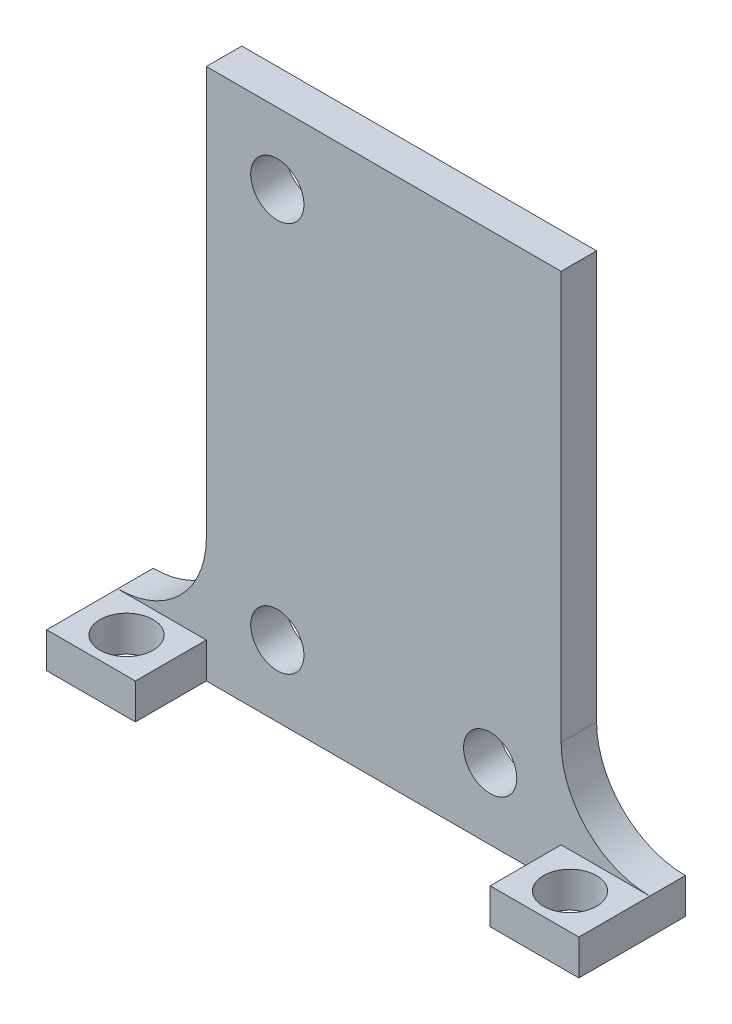
ISO-10303-21;
HEADER;
FILE_DESCRIPTION(('STEP AP214'),'2;1');
FILE_NAME('part.step','',(''),(''),'','','');
FILE_SCHEMA(('AUTOMOTIVE_DESIGN { 1 0 10303 214 1 1 1 1 }'));
ENDSEC;
DATA;
#1=APPLICATION_CONTEXT('core data for automotive mechanical design processes');
#2=APPLICATION_PROTOCOL_DEFINITION('international standard','automotive_design',2000,#1);
#3=PRODUCT_CONTEXT('',#1,'mechanical');
#4=PRODUCT('Part','Part','',(#3));
#5=PRODUCT_RELATED_PRODUCT_CATEGORY('part','',(#4));
#6=PRODUCT_DEFINITION_FORMATION('','',#4);
#7=PRODUCT_DEFINITION_CONTEXT('part definition',#1,'design');
#8=PRODUCT_DEFINITION('design','',#6,#7);
#9=PRODUCT_DEFINITION_SHAPE('','',#8);
#10=(LENGTH_UNIT() NAMED_UNIT(*) SI_UNIT(.MILLI.,.METRE.));
#11=(NAMED_UNIT(*) PLANE_ANGLE_UNIT() SI_UNIT($,.RADIAN.));
#12=(NAMED_UNIT(*) SI_UNIT($,.STERADIAN.) SOLID_ANGLE_UNIT());
#13=UNCERTAINTY_MEASURE_WITH_UNIT(LENGTH_MEASURE(1.E-05),#10,'distance_accuracy_value','');
#14=(GEOMETRIC_REPRESENTATION_CONTEXT(3) GLOBAL_UNCERTAINTY_ASSIGNED_CONTEXT((#13)) GLOBAL_UNIT_ASSIGNED_CONTEXT((#10,
#11,#12)) REPRESENTATION_CONTEXT('',''));
#15=CARTESIAN_POINT('',(0.,0.,0.));
#16=DIRECTION('',(0.,0.,1.));
#17=DIRECTION('',(1.,0.,0.));
#18=AXIS2_PLACEMENT_3D('',#15,#16,#17);
#19=CARTESIAN_POINT('',(12.7,-19.05,1.27));
#20=DIRECTION('',(-1.,0.,0.));
#21=DIRECTION('',(0.,0.,1.));
#22=AXIS2_PLACEMENT_3D('',#19,#20,#21);
#23=PLANE('',#22);
#24=DIRECTION('',(0.,1.,0.));
#25=VECTOR('',#24,1.);
#26=CARTESIAN_POINT('',(12.7,-19.05,1.27));
#27=LINE('',#26,#25);
#28=CARTESIAN_POINT('',(12.7,-10.16,1.27));
#29=VERTEX_POINT('',#28);
#30=CARTESIAN_POINT('',(12.7,19.05,1.27));
#31=VERTEX_POINT('',#30);
#32=EDGE_CURVE('E265',#29,#31,#27,.T.);
#33=ORIENTED_EDGE('',*,*,#32,.F.);
#34=DIRECTION('',(0.,0.,1.));
#35=VECTOR('',#34,1.);
#36=CARTESIAN_POINT('',(12.7,-10.16,1.27));
#37=LINE('',#36,#35);
#38=CARTESIAN_POINT('',(12.7,-10.16,-1.27));
#39=VERTEX_POINT('',#38);
#40=EDGE_CURVE('E298',#29,#39,#37,.F.);
#41=ORIENTED_EDGE('',*,*,#40,.T.);
#42=DIRECTION('',(0.,1.,0.));
#43=VECTOR('',#42,1.);
#44=CARTESIAN_POINT('',(12.7,-19.05,-1.27));
#45=LINE('',#44,#43);
#46=CARTESIAN_POINT('',(12.7,19.05,-1.27));
#47=VERTEX_POINT('',#46);
#48=EDGE_CURVE('E145',#39,#47,#45,.T.);
#49=ORIENTED_EDGE('',*,*,#48,.T.);
#50=DIRECTION('',(0.,0.,-1.));
#51=VECTOR('',#50,1.);
#52=CARTESIAN_POINT('',(12.7,19.05,1.27));
#53=LINE('',#52,#51);
#54=EDGE_CURVE('E291',#31,#47,#53,.T.);
#55=ORIENTED_EDGE('',*,*,#54,.F.);
#56=EDGE_LOOP('',(#33,#41,#49,#55));
#57=FACE_BOUND('',#56,.T.);
#58=ADVANCED_FACE('F45',(#57),#23,.F.);
#59=CARTESIAN_POINT('',(0.,0.,1.27));
#60=DIRECTION('',(0.,0.,-1.));
#61=DIRECTION('',(-1.,0.,0.));
#62=AXIS2_PLACEMENT_3D('',#59,#60,#61);
#63=PLANE('',#62);
#64=CARTESIAN_POINT('',(12.7,-19.05,1.27));
#65=VERTEX_POINT('',#64);
#66=CARTESIAN_POINT('',(12.7,-16.51,1.27));
#67=VERTEX_POINT('',#66);
#68=EDGE_CURVE('E260',#65,#67,#27,.T.);
#69=ORIENTED_EDGE('',*,*,#68,.T.);
#70=DIRECTION('',(-1.,0.,0.));
#71=VECTOR('',#70,1.);
#72=CARTESIAN_POINT('',(0.,-16.51,1.27));
#73=LINE('',#72,#71);
#74=CARTESIAN_POINT('',(19.05,-16.51,1.27));
#75=VERTEX_POINT('',#74);
#76=EDGE_CURVE('E295',#75,#67,#73,.T.);
#77=ORIENTED_EDGE('',*,*,#76,.F.);
#78=CARTESIAN_POINT('',(19.05,-10.16,1.27));
#79=DIRECTION('',(0.,0.,-1.));
#80=DIRECTION('',(-1.,0.,0.));
#81=AXIS2_PLACEMENT_3D('',#78,#79,#80);
#82=CIRCLE('',#81,6.35);
#83=EDGE_CURVE('E150',#75,#29,#82,.T.);
#84=ORIENTED_EDGE('',*,*,#83,.T.);
#85=ORIENTED_EDGE('',*,*,#32,.T.);
#86=DIRECTION('',(-1.,0.,0.));
#87=VECTOR('',#86,1.);
#88=CARTESIAN_POINT('',(-12.7,19.05,1.27));
#89=LINE('',#88,#87);
#90=CARTESIAN_POINT('',(-12.7,19.05,1.27));
#91=VERTEX_POINT('',#90);
#92=EDGE_CURVE('E264',#31,#91,#89,.T.);
#93=ORIENTED_EDGE('',*,*,#92,.T.);
#94=DIRECTION('',(0.,-1.,0.));
#95=VECTOR('',#94,1.);
#96=CARTESIAN_POINT('',(-12.7,-19.05,1.27));
#97=LINE('',#96,#95);
#98=CARTESIAN_POINT('',(-12.7,-10.16,1.27));
#99=VERTEX_POINT('',#98);
#100=EDGE_CURVE('E269',#91,#99,#97,.T.);
#101=ORIENTED_EDGE('',*,*,#100,.T.);
#102=CARTESIAN_POINT('',(-19.05,-10.16,1.27));
#103=DIRECTION('',(0.,0.,-1.));
#104=DIRECTION('',(-1.,0.,0.));
#105=AXIS2_PLACEMENT_3D('',#102,#103,#104);
#106=CIRCLE('',#105,6.35);
#107=CARTESIAN_POINT('',(-19.05,-16.51,1.27));
#108=VERTEX_POINT('',#107);
#109=EDGE_CURVE('E54',#99,#108,#106,.T.);
#110=ORIENTED_EDGE('',*,*,#109,.T.);
#111=DIRECTION('',(-1.,0.,0.));
#112=VECTOR('',#111,1.);
#113=CARTESIAN_POINT('',(0.,-16.51,1.27));
#114=LINE('',#113,#112);
#115=CARTESIAN_POINT('',(-12.7,-16.51,1.27));
#116=VERTEX_POINT('',#115);
#117=EDGE_CURVE('E61',#116,#108,#114,.T.);
#118=ORIENTED_EDGE('',*,*,#117,.F.);
#119=CARTESIAN_POINT('',(-12.7,-19.05,1.27));
#120=VERTEX_POINT('',#119);
#121=EDGE_CURVE('E268',#116,#120,#97,.T.);
#122=ORIENTED_EDGE('',*,*,#121,.T.);
#123=DIRECTION('',(1.,0.,0.));
#124=VECTOR('',#123,1.);
#125=CARTESIAN_POINT('',(-12.7,-19.05,1.27));
#126=LINE('',#125,#124);
#127=EDGE_CURVE('E272',#120,#65,#126,.T.);
#128=ORIENTED_EDGE('',*,*,#127,.T.);
#129=EDGE_LOOP('',(#69,#77,#84,#85,#93,#101,#110,#118,#122,#128));
#130=FACE_BOUND('',#129,.T.);
#131=CARTESIAN_POINT('',(-7.62,13.97,1.27));
#132=DIRECTION('',(0.,0.,1.));
#133=DIRECTION('',(1.,0.,0.));
#134=AXIS2_PLACEMENT_3D('',#131,#132,#133);
#135=CIRCLE('',#134,1.905);
#136=CARTESIAN_POINT('',(-5.715,13.97,1.27));
#137=VERTEX_POINT('',#136);
#138=EDGE_CURVE('E253',#137,#137,#135,.T.);
#139=ORIENTED_EDGE('',*,*,#138,.F.);
#140=EDGE_LOOP('',(#139));
#141=FACE_BOUND('',#140,.T.);
#142=CARTESIAN_POINT('',(-7.62,-13.97,1.27));
#143=DIRECTION('',(0.,0.,1.));
#144=DIRECTION('',(1.,0.,0.));
#145=AXIS2_PLACEMENT_3D('',#142,#143,#144);
#146=CIRCLE('',#145,1.905);
#147=CARTESIAN_POINT('',(-5.715,-13.97,1.27));
#148=VERTEX_POINT('',#147);
#149=EDGE_CURVE('E245',#148,#148,#146,.T.);
#150=ORIENTED_EDGE('',*,*,#149,.F.);
#151=EDGE_LOOP('',(#150));
#152=FACE_BOUND('',#151,.T.);
#153=CARTESIAN_POINT('',(7.62,-13.97,1.27));
#154=DIRECTION('',(0.,0.,1.));
#155=DIRECTION('',(1.,0.,0.));
#156=AXIS2_PLACEMENT_3D('',#153,#154,#155);
#157=CIRCLE('',#156,1.905);
#158=CARTESIAN_POINT('',(9.525,-13.97,1.27));
#159=VERTEX_POINT('',#158);
#160=EDGE_CURVE('E237',#159,#159,#157,.T.);
#161=ORIENTED_EDGE('',*,*,#160,.F.);
#162=EDGE_LOOP('',(#161));
#163=FACE_BOUND('',#162,.T.);
#164=ADVANCED_FACE('F325',(#130,#141,#152,#163),#63,.F.);
#165=CARTESIAN_POINT('',(0.,0.,-1.27));
#166=DIRECTION('',(0.,0.,-1.));
#167=DIRECTION('',(-1.,0.,0.));
#168=AXIS2_PLACEMENT_3D('',#165,#166,#167);
#169=PLANE('',#168);
#170=CARTESIAN_POINT('',(-7.62,-13.97,-1.27));
#171=DIRECTION('',(0.,0.,1.));
#172=DIRECTION('',(1.,0.,0.));
#173=AXIS2_PLACEMENT_3D('',#170,#171,#172);
#174=CIRCLE('',#173,1.905);
#175=CARTESIAN_POINT('',(-5.715,-13.97,-1.27));
#176=VERTEX_POINT('',#175);
#177=EDGE_CURVE('E241',#176,#176,#174,.T.);
#178=ORIENTED_EDGE('',*,*,#177,.T.);
#179=EDGE_LOOP('',(#178));
#180=FACE_BOUND('',#179,.T.);
#181=ORIENTED_EDGE('',*,*,#48,.F.);
#182=CARTESIAN_POINT('',(19.05,-10.16,-1.27));
#183=DIRECTION('',(0.,0.,-1.));
#184=DIRECTION('',(-1.,0.,0.));
#185=AXIS2_PLACEMENT_3D('',#182,#183,#184);
#186=CIRCLE('',#185,6.35);
#187=CARTESIAN_POINT('',(19.05,-16.51,-1.27));
#188=VERTEX_POINT('',#187);
#189=EDGE_CURVE('E139',#39,#188,#186,.F.);
#190=ORIENTED_EDGE('',*,*,#189,.T.);
#191=DIRECTION('',(0.,-1.,0.));
#192=VECTOR('',#191,1.);
#193=CARTESIAN_POINT('',(19.05,-16.51,-1.27));
#194=LINE('',#193,#192);
#195=CARTESIAN_POINT('',(19.05,-19.05,-1.27));
#196=VERTEX_POINT('',#195);
#197=EDGE_CURVE('E143',#188,#196,#194,.T.);
#198=ORIENTED_EDGE('',*,*,#197,.T.);
#199=DIRECTION('',(1.,0.,0.));
#200=VECTOR('',#199,1.);
#201=CARTESIAN_POINT('',(-12.7,-19.05,-1.27));
#202=LINE('',#201,#200);
#203=CARTESIAN_POINT('',(-19.05,-19.05,-1.27));
#204=VERTEX_POINT('',#203);
#205=EDGE_CURVE('E285',#204,#196,#202,.T.);
#206=ORIENTED_EDGE('',*,*,#205,.F.);
#207=DIRECTION('',(0.,-1.,0.));
#208=VECTOR('',#207,1.);
#209=CARTESIAN_POINT('',(-19.05,-16.51,-1.27));
#210=LINE('',#209,#208);
#211=CARTESIAN_POINT('',(-19.05,-16.51,-1.27));
#212=VERTEX_POINT('',#211);
#213=EDGE_CURVE('E226',#212,#204,#210,.T.);
#214=ORIENTED_EDGE('',*,*,#213,.F.);
#215=CARTESIAN_POINT('',(-19.05,-10.16,-1.27));
#216=DIRECTION('',(0.,0.,-1.));
#217=DIRECTION('',(-1.,0.,0.));
#218=AXIS2_PLACEMENT_3D('',#215,#216,#217);
#219=CIRCLE('',#218,6.35);
#220=CARTESIAN_POINT('',(-12.7,-10.16,-1.27));
#221=VERTEX_POINT('',#220);
#222=EDGE_CURVE('E11',#212,#221,#219,.F.);
#223=ORIENTED_EDGE('',*,*,#222,.T.);
#224=DIRECTION('',(0.,-1.,0.));
#225=VECTOR('',#224,1.);
#226=CARTESIAN_POINT('',(-12.7,-19.05,-1.27));
#227=LINE('',#226,#225);
#228=CARTESIAN_POINT('',(-12.7,19.05,-1.27));
#229=VERTEX_POINT('',#228);
#230=EDGE_CURVE('E281',#229,#221,#227,.T.);
#231=ORIENTED_EDGE('',*,*,#230,.F.);
#232=DIRECTION('',(-1.,0.,0.));
#233=VECTOR('',#232,1.);
#234=CARTESIAN_POINT('',(-12.7,19.05,-1.27));
#235=LINE('',#234,#233);
#236=EDGE_CURVE('E278',#47,#229,#235,.T.);
#237=ORIENTED_EDGE('',*,*,#236,.F.);
#238=EDGE_LOOP('',(#181,#190,#198,#206,#214,#223,#231,#237));
#239=FACE_BOUND('',#238,.T.);
#240=CARTESIAN_POINT('',(-7.62,13.97,-1.27));
#241=DIRECTION('',(0.,0.,1.));
#242=DIRECTION('',(1.,0.,0.));
#243=AXIS2_PLACEMENT_3D('',#240,#241,#242);
#244=CIRCLE('',#243,1.905);
#245=CARTESIAN_POINT('',(-5.715,13.97,-1.27));
#246=VERTEX_POINT('',#245);
#247=EDGE_CURVE('E249',#246,#246,#244,.T.);
#248=ORIENTED_EDGE('',*,*,#247,.T.);
#249=EDGE_LOOP('',(#248));
#250=FACE_BOUND('',#249,.T.);
#251=CARTESIAN_POINT('',(7.62,-13.97,-1.27));
#252=DIRECTION('',(0.,0.,1.));
#253=DIRECTION('',(1.,0.,0.));
#254=AXIS2_PLACEMENT_3D('',#251,#252,#253);
#255=CIRCLE('',#254,1.905);
#256=CARTESIAN_POINT('',(9.525,-13.97,-1.27));
#257=VERTEX_POINT('',#256);
#258=EDGE_CURVE('E230',#257,#257,#255,.T.);
#259=ORIENTED_EDGE('',*,*,#258,.T.);
#260=EDGE_LOOP('',(#259));
#261=FACE_BOUND('',#260,.T.);
#262=ADVANCED_FACE('F141',(#180,#239,#250,#261),#169,.T.);
#263=CARTESIAN_POINT('',(-12.7,19.05,1.27));
#264=DIRECTION('',(0.,-1.,0.));
#265=DIRECTION('',(0.,0.,-1.));
#266=AXIS2_PLACEMENT_3D('',#263,#264,#265);
#267=PLANE('',#266);
#268=ORIENTED_EDGE('',*,*,#236,.T.);
#269=DIRECTION('',(0.,0.,-1.));
#270=VECTOR('',#269,1.);
#271=CARTESIAN_POINT('',(-12.7,19.05,1.27));
#272=LINE('',#271,#270);
#273=EDGE_CURVE('E275',#91,#229,#272,.T.);
#274=ORIENTED_EDGE('',*,*,#273,.F.);
#275=ORIENTED_EDGE('',*,*,#92,.F.);
#276=ORIENTED_EDGE('',*,*,#54,.T.);
#277=EDGE_LOOP('',(#268,#274,#275,#276));
#278=FACE_BOUND('',#277,.T.);
#279=ADVANCED_FACE('F332',(#278),#267,.F.);
#280=CARTESIAN_POINT('',(-12.7,-19.05,1.27));
#281=DIRECTION('',(1.,0.,0.));
#282=DIRECTION('',(0.,0.,-1.));
#283=AXIS2_PLACEMENT_3D('',#280,#281,#282);
#284=PLANE('',#283);
#285=ORIENTED_EDGE('',*,*,#230,.T.);
#286=DIRECTION('',(0.,0.,1.));
#287=VECTOR('',#286,1.);
#288=CARTESIAN_POINT('',(-12.7,-10.16,1.27));
#289=LINE('',#288,#287);
#290=EDGE_CURVE('E301',#221,#99,#289,.T.);
#291=ORIENTED_EDGE('',*,*,#290,.T.);
#292=ORIENTED_EDGE('',*,*,#100,.F.);
#293=ORIENTED_EDGE('',*,*,#273,.T.);
#294=EDGE_LOOP('',(#285,#291,#292,#293));
#295=FACE_BOUND('',#294,.T.);
#296=ADVANCED_FACE('F324',(#295),#284,.F.);
#297=CARTESIAN_POINT('',(-12.7,-19.05,1.27));
#298=DIRECTION('',(0.,1.,0.));
#299=DIRECTION('',(0.,0.,1.));
#300=AXIS2_PLACEMENT_3D('',#297,#298,#299);
#301=PLANE('',#300);
#302=ORIENTED_EDGE('',*,*,#205,.T.);
#303=DIRECTION('',(0.,0.,-1.));
#304=VECTOR('',#303,1.);
#305=CARTESIAN_POINT('',(19.05,-19.05,6.35));
#306=LINE('',#305,#304);
#307=CARTESIAN_POINT('',(19.05,-19.05,6.35));
#308=VERTEX_POINT('',#307);
#309=EDGE_CURVE('E161',#308,#196,#306,.T.);
#310=ORIENTED_EDGE('',*,*,#309,.F.);
#311=DIRECTION('',(1.,0.,0.));
#312=VECTOR('',#311,1.);
#313=CARTESIAN_POINT('',(12.7,-19.05,6.35));
#314=LINE('',#313,#312);
#315=CARTESIAN_POINT('',(12.7,-19.05,6.35));
#316=VERTEX_POINT('',#315);
#317=EDGE_CURVE('E174',#316,#308,#314,.T.);
#318=ORIENTED_EDGE('',*,*,#317,.F.);
#319=DIRECTION('',(0.,0.,1.));
#320=VECTOR('',#319,1.);
#321=CARTESIAN_POINT('',(12.7,-19.05,6.35));
#322=LINE('',#321,#320);
#323=EDGE_CURVE('E180',#65,#316,#322,.T.);
#324=ORIENTED_EDGE('',*,*,#323,.F.);
#325=ORIENTED_EDGE('',*,*,#127,.F.);
#326=DIRECTION('',(0.,0.,1.));
#327=VECTOR('',#326,1.);
#328=CARTESIAN_POINT('',(-12.7,-19.05,6.35));
#329=LINE('',#328,#327);
#330=CARTESIAN_POINT('',(-12.7,-19.05,6.35));
#331=VERTEX_POINT('',#330);
#332=EDGE_CURVE('E199',#120,#331,#329,.T.);
#333=ORIENTED_EDGE('',*,*,#332,.T.);
#334=DIRECTION('',(-1.,0.,0.));
#335=VECTOR('',#334,1.);
#336=CARTESIAN_POINT('',(-12.7,-19.05,6.35));
#337=LINE('',#336,#335);
#338=CARTESIAN_POINT('',(-19.05,-19.05,6.35));
#339=VERTEX_POINT('',#338);
#340=EDGE_CURVE('E219',#331,#339,#337,.T.);
#341=ORIENTED_EDGE('',*,*,#340,.T.);
#342=DIRECTION('',(0.,0.,-1.));
#343=VECTOR('',#342,1.);
#344=CARTESIAN_POINT('',(-19.05,-19.05,6.35));
#345=LINE('',#344,#343);
#346=EDGE_CURVE('E207',#339,#204,#345,.T.);
#347=ORIENTED_EDGE('',*,*,#346,.T.);
#348=EDGE_LOOP('',(#302,#310,#318,#324,#325,#333,#341,#347));
#349=FACE_BOUND('',#348,.T.);
#350=CARTESIAN_POINT('',(-15.875,-19.05,3.81));
#351=DIRECTION('',(0.,-1.,0.));
#352=DIRECTION('',(0.,0.,-1.));
#353=AXIS2_PLACEMENT_3D('',#350,#351,#352);
#354=CIRCLE('',#353,1.905);
#355=CARTESIAN_POINT('',(-15.875,-19.05,1.905));
#356=VERTEX_POINT('',#355);
#357=EDGE_CURVE('E192',#356,#356,#354,.T.);
#358=ORIENTED_EDGE('',*,*,#357,.F.);
#359=EDGE_LOOP('',(#358));
#360=FACE_BOUND('',#359,.T.);
#361=CARTESIAN_POINT('',(15.875,-19.05,3.81));
#362=DIRECTION('',(0.,1.,0.));
#363=DIRECTION('',(0.,0.,-1.));
#364=AXIS2_PLACEMENT_3D('',#361,#362,#363);
#365=CIRCLE('',#364,1.905);
#366=CARTESIAN_POINT('',(15.875,-19.05,1.905));
#367=VERTEX_POINT('',#366);
#368=EDGE_CURVE('E544',#367,#367,#365,.T.);
#369=ORIENTED_EDGE('',*,*,#368,.T.);
#370=EDGE_LOOP('',(#369));
#371=FACE_BOUND('',#370,.T.);
#372=ADVANCED_FACE('F397',(#349,#360,#371),#301,.F.);
#373=CARTESIAN_POINT('',(-7.62,13.97,1.27));
#374=DIRECTION('',(0.,0.,-1.));
#375=DIRECTION('',(-1.,0.,0.));
#376=AXIS2_PLACEMENT_3D('',#373,#374,#375);
#377=CYLINDRICAL_SURFACE('',#376,1.905);
#378=ORIENTED_EDGE('',*,*,#138,.T.);
#379=EDGE_LOOP('',(#378));
#380=FACE_BOUND('',#379,.T.);
#381=ORIENTED_EDGE('',*,*,#247,.F.);
#382=EDGE_LOOP('',(#381));
#383=FACE_BOUND('',#382,.T.);
#384=ADVANCED_FACE('F394',(#380,#383),#377,.F.);
#385=CARTESIAN_POINT('',(-7.62,-13.97,1.27));
#386=DIRECTION('',(0.,0.,-1.));
#387=DIRECTION('',(-1.,0.,0.));
#388=AXIS2_PLACEMENT_3D('',#385,#386,#387);
#389=CYLINDRICAL_SURFACE('',#388,1.905);
#390=ORIENTED_EDGE('',*,*,#149,.T.);
#391=EDGE_LOOP('',(#390));
#392=FACE_BOUND('',#391,.T.);
#393=ORIENTED_EDGE('',*,*,#177,.F.);
#394=EDGE_LOOP('',(#393));
#395=FACE_BOUND('',#394,.T.);
#396=ADVANCED_FACE('F390',(#392,#395),#389,.F.);
#397=CARTESIAN_POINT('',(7.62,-13.97,1.27));
#398=DIRECTION('',(0.,0.,-1.));
#399=DIRECTION('',(-1.,0.,0.));
#400=AXIS2_PLACEMENT_3D('',#397,#398,#399);
#401=CYLINDRICAL_SURFACE('',#400,1.905);
#402=ORIENTED_EDGE('',*,*,#160,.T.);
#403=EDGE_LOOP('',(#402));
#404=FACE_BOUND('',#403,.T.);
#405=ORIENTED_EDGE('',*,*,#258,.F.);
#406=EDGE_LOOP('',(#405));
#407=FACE_BOUND('',#406,.T.);
#408=ADVANCED_FACE('F386',(#404,#407),#401,.F.);
#409=CARTESIAN_POINT('',(-12.7,-16.51,6.35));
#410=DIRECTION('',(1.,0.,0.));
#411=DIRECTION('',(0.,0.,-1.));
#412=AXIS2_PLACEMENT_3D('',#409,#410,#411);
#413=PLANE('',#412);
#414=ORIENTED_EDGE('',*,*,#121,.F.);
#415=DIRECTION('',(0.,0.,1.));
#416=VECTOR('',#415,1.);
#417=CARTESIAN_POINT('',(-12.7,-16.51,6.35));
#418=LINE('',#417,#416);
#419=CARTESIAN_POINT('',(-12.7,-16.51,6.35));
#420=VERTEX_POINT('',#419);
#421=EDGE_CURVE('E203',#116,#420,#418,.T.);
#422=ORIENTED_EDGE('',*,*,#421,.T.);
#423=DIRECTION('',(0.,-1.,0.));
#424=VECTOR('',#423,1.);
#425=CARTESIAN_POINT('',(-12.7,-16.51,6.35));
#426=LINE('',#425,#424);
#427=EDGE_CURVE('E216',#420,#331,#426,.T.);
#428=ORIENTED_EDGE('',*,*,#427,.T.);
#429=ORIENTED_EDGE('',*,*,#332,.F.);
#430=EDGE_LOOP('',(#414,#422,#428,#429));
#431=FACE_BOUND('',#430,.T.);
#432=ADVANCED_FACE('F380',(#431),#413,.T.);
#433=CARTESIAN_POINT('',(-19.05,-16.51,6.35));
#434=DIRECTION('',(-1.,0.,0.));
#435=DIRECTION('',(0.,0.,1.));
#436=AXIS2_PLACEMENT_3D('',#433,#434,#435);
#437=PLANE('',#436);
#438=ORIENTED_EDGE('',*,*,#346,.F.);
#439=DIRECTION('',(0.,-1.,0.));
#440=VECTOR('',#439,1.);
#441=CARTESIAN_POINT('',(-19.05,-16.51,6.35));
#442=LINE('',#441,#440);
#443=CARTESIAN_POINT('',(-19.05,-16.51,6.35));
#444=VERTEX_POINT('',#443);
#445=EDGE_CURVE('E231',#444,#339,#442,.T.);
#446=ORIENTED_EDGE('',*,*,#445,.F.);
#447=DIRECTION('',(0.,0.,-1.));
#448=VECTOR('',#447,1.);
#449=CARTESIAN_POINT('',(-19.05,-16.51,6.35));
#450=LINE('',#449,#448);
#451=EDGE_CURVE('E212',#444,#108,#450,.T.);
#452=ORIENTED_EDGE('',*,*,#451,.T.);
#453=EDGE_CURVE('E211',#108,#212,#450,.T.);
#454=ORIENTED_EDGE('',*,*,#453,.T.);
#455=ORIENTED_EDGE('',*,*,#213,.T.);
#456=EDGE_LOOP('',(#438,#446,#452,#454,#455));
#457=FACE_BOUND('',#456,.T.);
#458=ADVANCED_FACE('F316',(#457),#437,.T.);
#459=CARTESIAN_POINT('',(-12.7,-16.51,6.35));
#460=DIRECTION('',(0.,0.,1.));
#461=DIRECTION('',(1.,0.,0.));
#462=AXIS2_PLACEMENT_3D('',#459,#460,#461);
#463=PLANE('',#462);
#464=ORIENTED_EDGE('',*,*,#340,.F.);
#465=ORIENTED_EDGE('',*,*,#427,.F.);
#466=DIRECTION('',(-1.,0.,0.));
#467=VECTOR('',#466,1.);
#468=CARTESIAN_POINT('',(-12.7,-16.51,6.35));
#469=LINE('',#468,#467);
#470=EDGE_CURVE('E206',#420,#444,#469,.T.);
#471=ORIENTED_EDGE('',*,*,#470,.T.);
#472=ORIENTED_EDGE('',*,*,#445,.T.);
#473=EDGE_LOOP('',(#464,#465,#471,#472));
#474=FACE_BOUND('',#473,.T.);
#475=ADVANCED_FACE('F376',(#474),#463,.T.);
#476=CARTESIAN_POINT('',(0.,-16.51,0.));
#477=DIRECTION('',(0.,1.,0.));
#478=DIRECTION('',(0.,0.,1.));
#479=AXIS2_PLACEMENT_3D('',#476,#477,#478);
#480=PLANE('',#479);
#481=CARTESIAN_POINT('',(-15.875,-16.51,3.81));
#482=DIRECTION('',(0.,-1.,0.));
#483=DIRECTION('',(0.,0.,-1.));
#484=AXIS2_PLACEMENT_3D('',#481,#482,#483);
#485=CIRCLE('',#484,1.905);
#486=CARTESIAN_POINT('',(-15.875,-16.51,1.905));
#487=VERTEX_POINT('',#486);
#488=EDGE_CURVE('E195',#487,#487,#485,.T.);
#489=ORIENTED_EDGE('',*,*,#488,.T.);
#490=EDGE_LOOP('',(#489));
#491=FACE_BOUND('',#490,.T.);
#492=ORIENTED_EDGE('',*,*,#421,.F.);
#493=ORIENTED_EDGE('',*,*,#117,.T.);
#494=ORIENTED_EDGE('',*,*,#451,.F.);
#495=ORIENTED_EDGE('',*,*,#470,.F.);
#496=EDGE_LOOP('',(#492,#493,#494,#495));
#497=FACE_BOUND('',#496,.T.);
#498=ADVANCED_FACE('F372',(#491,#497),#480,.T.);
#499=CARTESIAN_POINT('',(-15.875,-16.51,3.81));
#500=DIRECTION('',(0.,-1.,0.));
#501=DIRECTION('',(0.,0.,-1.));
#502=AXIS2_PLACEMENT_3D('',#499,#500,#501);
#503=CYLINDRICAL_SURFACE('',#502,1.905);
#504=ORIENTED_EDGE('',*,*,#488,.F.);
#505=EDGE_LOOP('',(#504));
#506=FACE_BOUND('',#505,.T.);
#507=ORIENTED_EDGE('',*,*,#357,.T.);
#508=EDGE_LOOP('',(#507));
#509=FACE_BOUND('',#508,.T.);
#510=ADVANCED_FACE('F363',(#506,#509),#503,.F.);
#511=CARTESIAN_POINT('',(0.,-16.51,0.));
#512=DIRECTION('',(0.,1.,0.));
#513=DIRECTION('',(0.,0.,1.));
#514=AXIS2_PLACEMENT_3D('',#511,#512,#513);
#515=PLANE('',#514);
#516=DIRECTION('',(0.,0.,-1.));
#517=VECTOR('',#516,1.);
#518=CARTESIAN_POINT('',(19.05,-16.51,6.35));
#519=LINE('',#518,#517);
#520=CARTESIAN_POINT('',(19.05,-16.51,6.35));
#521=VERTEX_POINT('',#520);
#522=EDGE_CURVE('E169',#521,#75,#519,.T.);
#523=ORIENTED_EDGE('',*,*,#522,.T.);
#524=ORIENTED_EDGE('',*,*,#76,.T.);
#525=DIRECTION('',(0.,0.,1.));
#526=VECTOR('',#525,1.);
#527=CARTESIAN_POINT('',(12.7,-16.51,6.35));
#528=LINE('',#527,#526);
#529=CARTESIAN_POINT('',(12.7,-16.51,6.35));
#530=VERTEX_POINT('',#529);
#531=EDGE_CURVE('E170',#67,#530,#528,.T.);
#532=ORIENTED_EDGE('',*,*,#531,.T.);
#533=DIRECTION('',(1.,0.,0.));
#534=VECTOR('',#533,1.);
#535=CARTESIAN_POINT('',(12.7,-16.51,6.35));
#536=LINE('',#535,#534);
#537=EDGE_CURVE('E164',#530,#521,#536,.T.);
#538=ORIENTED_EDGE('',*,*,#537,.T.);
#539=EDGE_LOOP('',(#523,#524,#532,#538));
#540=FACE_BOUND('',#539,.T.);
#541=CARTESIAN_POINT('',(15.875,-16.51,3.81));
#542=DIRECTION('',(0.,1.,0.));
#543=DIRECTION('',(0.,0.,-1.));
#544=AXIS2_PLACEMENT_3D('',#541,#542,#543);
#545=CIRCLE('',#544,1.905);
#546=CARTESIAN_POINT('',(15.875,-16.51,1.905));
#547=VERTEX_POINT('',#546);
#548=EDGE_CURVE('E183',#547,#547,#545,.T.);
#549=ORIENTED_EDGE('',*,*,#548,.F.);
#550=EDGE_LOOP('',(#549));
#551=FACE_BOUND('',#550,.T.);
#552=ADVANCED_FACE('F359',(#540,#551),#515,.T.);
#553=CARTESIAN_POINT('',(12.7,-16.51,6.35));
#554=DIRECTION('',(1.,0.,0.));
#555=DIRECTION('',(0.,0.,-1.));
#556=AXIS2_PLACEMENT_3D('',#553,#554,#555);
#557=PLANE('',#556);
#558=ORIENTED_EDGE('',*,*,#68,.F.);
#559=ORIENTED_EDGE('',*,*,#323,.T.);
#560=DIRECTION('',(0.,-1.,0.));
#561=VECTOR('',#560,1.);
#562=CARTESIAN_POINT('',(12.7,-16.51,6.35));
#563=LINE('',#562,#561);
#564=EDGE_CURVE('E188',#530,#316,#563,.T.);
#565=ORIENTED_EDGE('',*,*,#564,.F.);
#566=ORIENTED_EDGE('',*,*,#531,.F.);
#567=EDGE_LOOP('',(#558,#559,#565,#566));
#568=FACE_BOUND('',#567,.T.);
#569=ADVANCED_FACE('F362',(#568),#557,.F.);
#570=CARTESIAN_POINT('',(12.7,-16.51,6.35));
#571=DIRECTION('',(0.,0.,-1.));
#572=DIRECTION('',(-1.,0.,0.));
#573=AXIS2_PLACEMENT_3D('',#570,#571,#572);
#574=PLANE('',#573);
#575=ORIENTED_EDGE('',*,*,#317,.T.);
#576=DIRECTION('',(0.,-1.,0.));
#577=VECTOR('',#576,1.);
#578=CARTESIAN_POINT('',(19.05,-16.51,6.35));
#579=LINE('',#578,#577);
#580=EDGE_CURVE('E163',#521,#308,#579,.T.);
#581=ORIENTED_EDGE('',*,*,#580,.F.);
#582=ORIENTED_EDGE('',*,*,#537,.F.);
#583=ORIENTED_EDGE('',*,*,#564,.T.);
#584=EDGE_LOOP('',(#575,#581,#582,#583));
#585=FACE_BOUND('',#584,.T.);
#586=ADVANCED_FACE('F354',(#585),#574,.F.);
#587=CARTESIAN_POINT('',(19.05,-16.51,6.35));
#588=DIRECTION('',(-1.,0.,0.));
#589=DIRECTION('',(0.,0.,1.));
#590=AXIS2_PLACEMENT_3D('',#587,#588,#589);
#591=PLANE('',#590);
#592=ORIENTED_EDGE('',*,*,#309,.T.);
#593=ORIENTED_EDGE('',*,*,#197,.F.);
#594=EDGE_CURVE('E157',#75,#188,#519,.T.);
#595=ORIENTED_EDGE('',*,*,#594,.F.);
#596=ORIENTED_EDGE('',*,*,#522,.F.);
#597=ORIENTED_EDGE('',*,*,#580,.T.);
#598=EDGE_LOOP('',(#592,#593,#595,#596,#597));
#599=FACE_BOUND('',#598,.T.);
#600=ADVANCED_FACE('F155',(#599),#591,.F.);
#601=CARTESIAN_POINT('',(15.875,-16.51,3.81));
#602=DIRECTION('',(0.,-1.,0.));
#603=DIRECTION('',(0.,0.,-1.));
#604=AXIS2_PLACEMENT_3D('',#601,#602,#603);
#605=CYLINDRICAL_SURFACE('',#604,1.905);
#606=ORIENTED_EDGE('',*,*,#548,.T.);
#607=EDGE_LOOP('',(#606));
#608=FACE_BOUND('',#607,.T.);
#609=ORIENTED_EDGE('',*,*,#368,.F.);
#610=EDGE_LOOP('',(#609));
#611=FACE_BOUND('',#610,.T.);
#612=ADVANCED_FACE('F344',(#608,#611),#605,.F.);
#613=CARTESIAN_POINT('',(19.05,-10.16,0.));
#614=DIRECTION('',(0.,0.,1.));
#615=DIRECTION('',(1.,0.,0.));
#616=AXIS2_PLACEMENT_3D('',#613,#614,#615);
#617=CYLINDRICAL_SURFACE('',#616,6.35);
#618=ORIENTED_EDGE('',*,*,#189,.F.);
#619=ORIENTED_EDGE('',*,*,#40,.F.);
#620=ORIENTED_EDGE('',*,*,#83,.F.);
#621=ORIENTED_EDGE('',*,*,#594,.T.);
#622=EDGE_LOOP('',(#618,#619,#620,#621));
#623=FACE_BOUND('',#622,.T.);
#624=ADVANCED_FACE('F166',(#623),#617,.F.);
#625=CARTESIAN_POINT('',(-19.05,-10.16,1.27));
#626=DIRECTION('',(0.,0.,1.));
#627=DIRECTION('',(1.,0.,0.));
#628=AXIS2_PLACEMENT_3D('',#625,#626,#627);
#629=CYLINDRICAL_SURFACE('',#628,6.35);
#630=ORIENTED_EDGE('',*,*,#222,.F.);
#631=ORIENTED_EDGE('',*,*,#453,.F.);
#632=ORIENTED_EDGE('',*,*,#109,.F.);
#633=ORIENTED_EDGE('',*,*,#290,.F.);
#634=EDGE_LOOP('',(#630,#631,#632,#633));
#635=FACE_BOUND('',#634,.T.);
#636=ADVANCED_FACE('F47',(#635),#629,.F.);
#637=CLOSED_SHELL('',(#58,#164,#262,#279,#296,#372,#384,#396,#408,#432,#458,#475,#498,#510,#552,
#569,#586,#600,#612,#624,#636));
#638=MANIFOLD_SOLID_BREP('B2',#637);
#639=ADVANCED_BREP_SHAPE_REPRESENTATION('',(#18,#638),#14);
#640=SHAPE_DEFINITION_REPRESENTATION(#9,#639);
ENDSEC;
END-ISO-10303-21;
